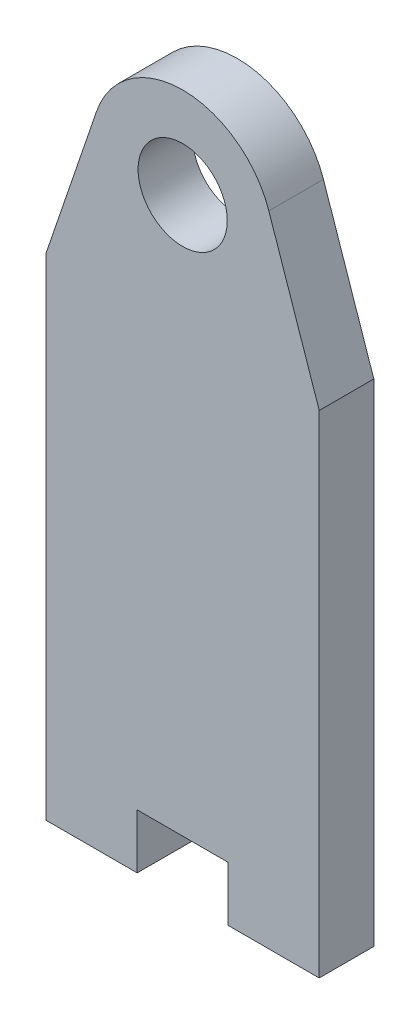
ISO-10303-21;
HEADER;
FILE_DESCRIPTION(('STEP AP214'),'2;1');
FILE_NAME('part.step','',(''),(''),'','','');
FILE_SCHEMA(('AUTOMOTIVE_DESIGN { 1 0 10303 214 1 1 1 1 }'));
ENDSEC;
DATA;
#1=APPLICATION_CONTEXT('core data for automotive mechanical design processes');
#2=APPLICATION_PROTOCOL_DEFINITION('international standard','automotive_design',2000,#1);
#3=PRODUCT_CONTEXT('',#1,'mechanical');
#4=PRODUCT('Part','Part','',(#3));
#5=PRODUCT_RELATED_PRODUCT_CATEGORY('part','',(#4));
#6=PRODUCT_DEFINITION_FORMATION('','',#4);
#7=PRODUCT_DEFINITION_CONTEXT('part definition',#1,'design');
#8=PRODUCT_DEFINITION('design','',#6,#7);
#9=PRODUCT_DEFINITION_SHAPE('','',#8);
#10=(LENGTH_UNIT() NAMED_UNIT(*) SI_UNIT(.MILLI.,.METRE.));
#11=(NAMED_UNIT(*) PLANE_ANGLE_UNIT() SI_UNIT($,.RADIAN.));
#12=(NAMED_UNIT(*) SI_UNIT($,.STERADIAN.) SOLID_ANGLE_UNIT());
#13=UNCERTAINTY_MEASURE_WITH_UNIT(LENGTH_MEASURE(1.E-05),#10,'distance_accuracy_value','');
#14=(GEOMETRIC_REPRESENTATION_CONTEXT(3) GLOBAL_UNCERTAINTY_ASSIGNED_CONTEXT((#13)) GLOBAL_UNIT_ASSIGNED_CONTEXT((#10,
#11,#12)) REPRESENTATION_CONTEXT('',''));
#15=CARTESIAN_POINT('',(0.,0.,0.));
#16=DIRECTION('',(0.,0.,1.));
#17=DIRECTION('',(1.,0.,0.));
#18=AXIS2_PLACEMENT_3D('',#15,#16,#17);
#19=CARTESIAN_POINT('',(28.9055016360546,30.9500000000045,3.));
#20=DIRECTION('',(0.,0.,1.));
#21=DIRECTION('',(1.,0.,0.));
#22=AXIS2_PLACEMENT_3D('',#19,#20,#21);
#23=PLANE('',#22);
#24=CARTESIAN_POINT('',(28.9055016360546,30.9500000000045,3.));
#25=DIRECTION('',(0.,0.,1.));
#26=DIRECTION('',(1.,0.,0.));
#27=AXIS2_PLACEMENT_3D('',#24,#25,#26);
#28=CIRCLE('',#27,5.00000000001172);
#29=CARTESIAN_POINT('',(33.6377803999347,32.5641678044929,3.));
#30=VERTEX_POINT('',#29);
#31=CARTESIAN_POINT('',(24.1732228721651,32.5641678044652,3.));
#32=VERTEX_POINT('',#31);
#33=EDGE_CURVE('E160',#30,#32,#28,.T.);
#34=ORIENTED_EDGE('',*,*,#33,.T.);
#35=DIRECTION('',(-0.322833560893949,-0.94645575277481,0.));
#36=VECTOR('',#35,1.);
#37=CARTESIAN_POINT('',(21.4055016360392,24.4499999999943,3.));
#38=LINE('',#37,#36);
#39=CARTESIAN_POINT('',(21.4055016360392,24.4499999999943,3.));
#40=VERTEX_POINT('',#39);
#41=EDGE_CURVE('E98',#32,#40,#38,.T.);
#42=ORIENTED_EDGE('',*,*,#41,.T.);
#43=DIRECTION('',(0.,-1.,0.));
#44=VECTOR('',#43,1.);
#45=CARTESIAN_POINT('',(21.4055016360392,24.4499999999943,3.));
#46=LINE('',#45,#44);
#47=CARTESIAN_POINT('',(21.4055016360392,-2.55000000000574,3.));
#48=VERTEX_POINT('',#47);
#49=EDGE_CURVE('E181',#40,#48,#46,.T.);
#50=ORIENTED_EDGE('',*,*,#49,.T.);
#51=DIRECTION('',(1.,2.1605980893295E-13,0.));
#52=VECTOR('',#51,1.);
#53=CARTESIAN_POINT('',(26.4055016360383,-2.55000000000466,3.));
#54=LINE('',#53,#52);
#55=CARTESIAN_POINT('',(26.4055016360383,-2.55000000000466,3.));
#56=VERTEX_POINT('',#55);
#57=EDGE_CURVE('E200',#48,#56,#54,.T.);
#58=ORIENTED_EDGE('',*,*,#57,.T.);
#59=DIRECTION('',(0.,1.,0.));
#60=VECTOR('',#59,1.);
#61=CARTESIAN_POINT('',(26.4055016360383,0.449999999995338,3.));
#62=LINE('',#61,#60);
#63=CARTESIAN_POINT('',(26.4055016360383,0.449999999995338,3.));
#64=VERTEX_POINT('',#63);
#65=EDGE_CURVE('E197',#56,#64,#62,.T.);
#66=ORIENTED_EDGE('',*,*,#65,.T.);
#67=DIRECTION('',(1.,0.,0.));
#68=VECTOR('',#67,1.);
#69=CARTESIAN_POINT('',(31.4055016360383,0.449999999995338,3.));
#70=LINE('',#69,#68);
#71=CARTESIAN_POINT('',(31.4055016360383,0.449999999995338,3.));
#72=VERTEX_POINT('',#71);
#73=EDGE_CURVE('E199',#64,#72,#70,.T.);
#74=ORIENTED_EDGE('',*,*,#73,.T.);
#75=DIRECTION('',(0.,-1.,0.));
#76=VECTOR('',#75,1.);
#77=CARTESIAN_POINT('',(31.4055016360383,-2.55000000000466,3.));
#78=LINE('',#77,#76);
#79=CARTESIAN_POINT('',(31.4055016360383,-2.55000000000466,3.));
#80=VERTEX_POINT('',#79);
#81=EDGE_CURVE('E123',#72,#80,#78,.T.);
#82=ORIENTED_EDGE('',*,*,#81,.T.);
#83=DIRECTION('',(1.,4.18588774753204E-13,0.));
#84=VECTOR('',#83,1.);
#85=CARTESIAN_POINT('',(36.4055016360383,-2.55000000000257,3.));
#86=LINE('',#85,#84);
#87=CARTESIAN_POINT('',(36.4055016360383,-2.55000000000257,3.));
#88=VERTEX_POINT('',#87);
#89=EDGE_CURVE('E117',#80,#88,#86,.T.);
#90=ORIENTED_EDGE('',*,*,#89,.T.);
#91=DIRECTION('',(0.,1.,0.));
#92=VECTOR('',#91,1.);
#93=CARTESIAN_POINT('',(36.4055016360383,24.4499999999943,3.));
#94=LINE('',#93,#92);
#95=CARTESIAN_POINT('',(36.4055016360383,24.4499999999943,3.));
#96=VERTEX_POINT('',#95);
#97=EDGE_CURVE('E121',#88,#96,#94,.T.);
#98=ORIENTED_EDGE('',*,*,#97,.T.);
#99=DIRECTION('',(-0.322833560890626,0.946455752775944,0.));
#100=VECTOR('',#99,1.);
#101=CARTESIAN_POINT('',(33.6377803999347,32.5641678044929,3.));
#102=LINE('',#101,#100);
#103=EDGE_CURVE('E49',#96,#30,#102,.T.);
#104=ORIENTED_EDGE('',*,*,#103,.T.);
#105=EDGE_LOOP('',(#34,#42,#50,#58,#66,#74,#82,#90,#98,#104));
#106=FACE_BOUND('',#105,.T.);
#107=CARTESIAN_POINT('',(28.9040840134805,30.9499999999941,3.));
#108=DIRECTION('',(0.,0.,1.));
#109=DIRECTION('',(1.,0.,0.));
#110=AXIS2_PLACEMENT_3D('',#107,#108,#109);
#111=CIRCLE('',#110,2.45);
#112=CARTESIAN_POINT('',(31.3540840134804,30.9499999999941,3.));
#113=VERTEX_POINT('',#112);
#114=EDGE_CURVE('E145',#113,#113,#111,.T.);
#115=ORIENTED_EDGE('',*,*,#114,.F.);
#116=EDGE_LOOP('',(#115));
#117=FACE_BOUND('',#116,.T.);
#118=ADVANCED_FACE('F32',(#106,#117),#23,.T.);
#119=CARTESIAN_POINT('',(28.9055016360546,30.9500000000045,0.));
#120=DIRECTION('',(0.,0.,1.));
#121=DIRECTION('',(1.,0.,0.));
#122=AXIS2_PLACEMENT_3D('',#119,#120,#121);
#123=PLANE('',#122);
#124=CARTESIAN_POINT('',(28.9055016360546,30.9500000000045,0.));
#125=DIRECTION('',(0.,0.,1.));
#126=DIRECTION('',(1.,0.,0.));
#127=AXIS2_PLACEMENT_3D('',#124,#125,#126);
#128=CIRCLE('',#127,5.00000000001172);
#129=CARTESIAN_POINT('',(33.6377803999347,32.5641678044929,0.));
#130=VERTEX_POINT('',#129);
#131=CARTESIAN_POINT('',(24.1732228721651,32.5641678044652,0.));
#132=VERTEX_POINT('',#131);
#133=EDGE_CURVE('E141',#130,#132,#128,.T.);
#134=ORIENTED_EDGE('',*,*,#133,.F.);
#135=DIRECTION('',(-0.322833560890626,0.946455752775944,0.));
#136=VECTOR('',#135,1.);
#137=CARTESIAN_POINT('',(33.6377803999347,32.5641678044929,0.));
#138=LINE('',#137,#136);
#139=CARTESIAN_POINT('',(36.4055016360383,24.4499999999943,0.));
#140=VERTEX_POINT('',#139);
#141=EDGE_CURVE('E90',#140,#130,#138,.T.);
#142=ORIENTED_EDGE('',*,*,#141,.F.);
#143=DIRECTION('',(0.,1.,0.));
#144=VECTOR('',#143,1.);
#145=CARTESIAN_POINT('',(36.4055016360383,24.4499999999943,0.));
#146=LINE('',#145,#144);
#147=CARTESIAN_POINT('',(36.4055016360383,-2.55000000000257,0.));
#148=VERTEX_POINT('',#147);
#149=EDGE_CURVE('E84',#148,#140,#146,.T.);
#150=ORIENTED_EDGE('',*,*,#149,.F.);
#151=DIRECTION('',(1.,4.18588774753204E-13,0.));
#152=VECTOR('',#151,1.);
#153=CARTESIAN_POINT('',(36.4055016360383,-2.55000000000257,0.));
#154=LINE('',#153,#152);
#155=CARTESIAN_POINT('',(31.4055016360383,-2.55000000000466,0.));
#156=VERTEX_POINT('',#155);
#157=EDGE_CURVE('E131',#156,#148,#154,.T.);
#158=ORIENTED_EDGE('',*,*,#157,.F.);
#159=DIRECTION('',(0.,-1.,0.));
#160=VECTOR('',#159,1.);
#161=CARTESIAN_POINT('',(31.4055016360383,-2.55000000000466,0.));
#162=LINE('',#161,#160);
#163=CARTESIAN_POINT('',(31.4055016360383,0.449999999995338,0.));
#164=VERTEX_POINT('',#163);
#165=EDGE_CURVE('E155',#164,#156,#162,.T.);
#166=ORIENTED_EDGE('',*,*,#165,.F.);
#167=DIRECTION('',(1.,0.,0.));
#168=VECTOR('',#167,1.);
#169=CARTESIAN_POINT('',(31.4055016360383,0.449999999995338,0.));
#170=LINE('',#169,#168);
#171=CARTESIAN_POINT('',(26.4055016360383,0.449999999995338,0.));
#172=VERTEX_POINT('',#171);
#173=EDGE_CURVE('E153',#172,#164,#170,.T.);
#174=ORIENTED_EDGE('',*,*,#173,.F.);
#175=DIRECTION('',(0.,1.,0.));
#176=VECTOR('',#175,1.);
#177=CARTESIAN_POINT('',(26.4055016360383,0.449999999995338,0.));
#178=LINE('',#177,#176);
#179=CARTESIAN_POINT('',(26.4055016360383,-2.55000000000466,0.));
#180=VERTEX_POINT('',#179);
#181=EDGE_CURVE('E151',#180,#172,#178,.T.);
#182=ORIENTED_EDGE('',*,*,#181,.F.);
#183=DIRECTION('',(1.,2.1605980893295E-13,0.));
#184=VECTOR('',#183,1.);
#185=CARTESIAN_POINT('',(26.4055016360383,-2.55000000000466,0.));
#186=LINE('',#185,#184);
#187=CARTESIAN_POINT('',(21.4055016360392,-2.55000000000574,0.));
#188=VERTEX_POINT('',#187);
#189=EDGE_CURVE('E149',#188,#180,#186,.T.);
#190=ORIENTED_EDGE('',*,*,#189,.F.);
#191=DIRECTION('',(0.,-1.,0.));
#192=VECTOR('',#191,1.);
#193=CARTESIAN_POINT('',(21.4055016360392,24.4499999999943,0.));
#194=LINE('',#193,#192);
#195=CARTESIAN_POINT('',(21.4055016360392,24.4499999999943,0.));
#196=VERTEX_POINT('',#195);
#197=EDGE_CURVE('E147',#196,#188,#194,.T.);
#198=ORIENTED_EDGE('',*,*,#197,.F.);
#199=DIRECTION('',(-0.322833560893949,-0.94645575277481,0.));
#200=VECTOR('',#199,1.);
#201=CARTESIAN_POINT('',(21.4055016360392,24.4499999999943,0.));
#202=LINE('',#201,#200);
#203=EDGE_CURVE('E144',#132,#196,#202,.T.);
#204=ORIENTED_EDGE('',*,*,#203,.F.);
#205=EDGE_LOOP('',(#134,#142,#150,#158,#166,#174,#182,#190,#198,#204));
#206=FACE_BOUND('',#205,.T.);
#207=CARTESIAN_POINT('',(28.9040840134805,30.9499999999941,0.));
#208=DIRECTION('',(0.,0.,1.));
#209=DIRECTION('',(1.,0.,0.));
#210=AXIS2_PLACEMENT_3D('',#207,#208,#209);
#211=CIRCLE('',#210,2.45);
#212=CARTESIAN_POINT('',(31.3540840134804,30.9499999999941,0.));
#213=VERTEX_POINT('',#212);
#214=EDGE_CURVE('E208',#213,#213,#211,.T.);
#215=ORIENTED_EDGE('',*,*,#214,.T.);
#216=EDGE_LOOP('',(#215));
#217=FACE_BOUND('',#216,.T.);
#218=ADVANCED_FACE('F185',(#206,#217),#123,.F.);
#219=CARTESIAN_POINT('',(28.9055016360546,30.9500000000045,3.));
#220=DIRECTION('',(0.,0.,-1.));
#221=DIRECTION('',(-1.,0.,0.));
#222=AXIS2_PLACEMENT_3D('',#219,#220,#221);
#223=CYLINDRICAL_SURFACE('',#222,5.00000000001172);
#224=ORIENTED_EDGE('',*,*,#133,.T.);
#225=DIRECTION('',(0.,0.,-1.));
#226=VECTOR('',#225,1.);
#227=CARTESIAN_POINT('',(24.1732228721651,32.5641678044652,3.));
#228=LINE('',#227,#226);
#229=EDGE_CURVE('E11',#32,#132,#228,.T.);
#230=ORIENTED_EDGE('',*,*,#229,.F.);
#231=ORIENTED_EDGE('',*,*,#33,.F.);
#232=DIRECTION('',(0.,0.,-1.));
#233=VECTOR('',#232,1.);
#234=CARTESIAN_POINT('',(33.6377803999347,32.5641678044929,3.));
#235=LINE('',#234,#233);
#236=EDGE_CURVE('E137',#30,#130,#235,.T.);
#237=ORIENTED_EDGE('',*,*,#236,.T.);
#238=EDGE_LOOP('',(#224,#230,#231,#237));
#239=FACE_BOUND('',#238,.T.);
#240=ADVANCED_FACE('F34',(#239),#223,.T.);
#241=CARTESIAN_POINT('',(21.4055016360392,24.4499999999943,3.));
#242=DIRECTION('',(0.94645575277481,-0.322833560893949,0.));
#243=DIRECTION('',(0.322833560893949,0.946455752774811,0.));
#244=AXIS2_PLACEMENT_3D('',#241,#242,#243);
#245=PLANE('',#244);
#246=ORIENTED_EDGE('',*,*,#203,.T.);
#247=DIRECTION('',(0.,0.,-1.));
#248=VECTOR('',#247,1.);
#249=CARTESIAN_POINT('',(21.4055016360392,24.4499999999943,3.));
#250=LINE('',#249,#248);
#251=EDGE_CURVE('E41',#40,#196,#250,.T.);
#252=ORIENTED_EDGE('',*,*,#251,.F.);
#253=ORIENTED_EDGE('',*,*,#41,.F.);
#254=ORIENTED_EDGE('',*,*,#229,.T.);
#255=EDGE_LOOP('',(#246,#252,#253,#254));
#256=FACE_BOUND('',#255,.T.);
#257=ADVANCED_FACE('F244',(#256),#245,.F.);
#258=CARTESIAN_POINT('',(21.4055016360392,24.4499999999943,3.));
#259=DIRECTION('',(1.,0.,0.));
#260=DIRECTION('',(0.,0.,-1.));
#261=AXIS2_PLACEMENT_3D('',#258,#259,#260);
#262=PLANE('',#261);
#263=ORIENTED_EDGE('',*,*,#197,.T.);
#264=DIRECTION('',(0.,0.,-1.));
#265=VECTOR('',#264,1.);
#266=CARTESIAN_POINT('',(21.4055016360392,-2.55000000000574,3.));
#267=LINE('',#266,#265);
#268=EDGE_CURVE('E173',#48,#188,#267,.T.);
#269=ORIENTED_EDGE('',*,*,#268,.F.);
#270=ORIENTED_EDGE('',*,*,#49,.F.);
#271=ORIENTED_EDGE('',*,*,#251,.T.);
#272=EDGE_LOOP('',(#263,#269,#270,#271));
#273=FACE_BOUND('',#272,.T.);
#274=ADVANCED_FACE('F179',(#273),#262,.F.);
#275=CARTESIAN_POINT('',(26.4055016360383,-2.55000000000466,3.));
#276=DIRECTION('',(-2.1605980893295E-13,1.,0.));
#277=DIRECTION('',(-1.,-2.1605980893295E-13,0.));
#278=AXIS2_PLACEMENT_3D('',#275,#276,#277);
#279=PLANE('',#278);
#280=ORIENTED_EDGE('',*,*,#189,.T.);
#281=DIRECTION('',(0.,0.,-1.));
#282=VECTOR('',#281,1.);
#283=CARTESIAN_POINT('',(26.4055016360383,-2.55000000000466,3.));
#284=LINE('',#283,#282);
#285=EDGE_CURVE('E170',#56,#180,#284,.T.);
#286=ORIENTED_EDGE('',*,*,#285,.F.);
#287=ORIENTED_EDGE('',*,*,#57,.F.);
#288=ORIENTED_EDGE('',*,*,#268,.T.);
#289=EDGE_LOOP('',(#280,#286,#287,#288));
#290=FACE_BOUND('',#289,.T.);
#291=ADVANCED_FACE('F191',(#290),#279,.F.);
#292=CARTESIAN_POINT('',(26.4055016360383,0.449999999995338,3.));
#293=DIRECTION('',(-1.,0.,0.));
#294=DIRECTION('',(0.,0.,1.));
#295=AXIS2_PLACEMENT_3D('',#292,#293,#294);
#296=PLANE('',#295);
#297=ORIENTED_EDGE('',*,*,#181,.T.);
#298=DIRECTION('',(0.,0.,-1.));
#299=VECTOR('',#298,1.);
#300=CARTESIAN_POINT('',(26.4055016360383,0.449999999995338,3.));
#301=LINE('',#300,#299);
#302=EDGE_CURVE('E167',#64,#172,#301,.T.);
#303=ORIENTED_EDGE('',*,*,#302,.F.);
#304=ORIENTED_EDGE('',*,*,#65,.F.);
#305=ORIENTED_EDGE('',*,*,#285,.T.);
#306=EDGE_LOOP('',(#297,#303,#304,#305));
#307=FACE_BOUND('',#306,.T.);
#308=ADVANCED_FACE('F195',(#307),#296,.F.);
#309=CARTESIAN_POINT('',(31.4055016360383,0.449999999995338,3.));
#310=DIRECTION('',(0.,1.,0.));
#311=DIRECTION('',(0.,0.,1.));
#312=AXIS2_PLACEMENT_3D('',#309,#310,#311);
#313=PLANE('',#312);
#314=ORIENTED_EDGE('',*,*,#173,.T.);
#315=DIRECTION('',(0.,0.,-1.));
#316=VECTOR('',#315,1.);
#317=CARTESIAN_POINT('',(31.4055016360383,0.449999999995338,3.));
#318=LINE('',#317,#316);
#319=EDGE_CURVE('E164',#72,#164,#318,.T.);
#320=ORIENTED_EDGE('',*,*,#319,.F.);
#321=ORIENTED_EDGE('',*,*,#73,.F.);
#322=ORIENTED_EDGE('',*,*,#302,.T.);
#323=EDGE_LOOP('',(#314,#320,#321,#322));
#324=FACE_BOUND('',#323,.T.);
#325=ADVANCED_FACE('F234',(#324),#313,.F.);
#326=CARTESIAN_POINT('',(31.4055016360383,-2.55000000000466,3.));
#327=DIRECTION('',(1.,0.,0.));
#328=DIRECTION('',(0.,0.,-1.));
#329=AXIS2_PLACEMENT_3D('',#326,#327,#328);
#330=PLANE('',#329);
#331=ORIENTED_EDGE('',*,*,#165,.T.);
#332=DIRECTION('',(0.,0.,-1.));
#333=VECTOR('',#332,1.);
#334=CARTESIAN_POINT('',(31.4055016360383,-2.55000000000466,3.));
#335=LINE('',#334,#333);
#336=EDGE_CURVE('E132',#80,#156,#335,.T.);
#337=ORIENTED_EDGE('',*,*,#336,.F.);
#338=ORIENTED_EDGE('',*,*,#81,.F.);
#339=ORIENTED_EDGE('',*,*,#319,.T.);
#340=EDGE_LOOP('',(#331,#337,#338,#339));
#341=FACE_BOUND('',#340,.T.);
#342=ADVANCED_FACE('F231',(#341),#330,.F.);
#343=CARTESIAN_POINT('',(36.4055016360383,-2.55000000000257,3.));
#344=DIRECTION('',(-4.18588774753204E-13,1.,0.));
#345=DIRECTION('',(-1.,-4.18588774753204E-13,0.));
#346=AXIS2_PLACEMENT_3D('',#343,#344,#345);
#347=PLANE('',#346);
#348=ORIENTED_EDGE('',*,*,#157,.T.);
#349=DIRECTION('',(0.,0.,-1.));
#350=VECTOR('',#349,1.);
#351=CARTESIAN_POINT('',(36.4055016360383,-2.55000000000257,3.));
#352=LINE('',#351,#350);
#353=EDGE_CURVE('E128',#88,#148,#352,.T.);
#354=ORIENTED_EDGE('',*,*,#353,.F.);
#355=ORIENTED_EDGE('',*,*,#89,.F.);
#356=ORIENTED_EDGE('',*,*,#336,.T.);
#357=EDGE_LOOP('',(#348,#354,#355,#356));
#358=FACE_BOUND('',#357,.T.);
#359=ADVANCED_FACE('F129',(#358),#347,.F.);
#360=CARTESIAN_POINT('',(36.4055016360383,24.4499999999943,3.));
#361=DIRECTION('',(-1.,0.,0.));
#362=DIRECTION('',(0.,0.,1.));
#363=AXIS2_PLACEMENT_3D('',#360,#361,#362);
#364=PLANE('',#363);
#365=ORIENTED_EDGE('',*,*,#149,.T.);
#366=DIRECTION('',(0.,0.,-1.));
#367=VECTOR('',#366,1.);
#368=CARTESIAN_POINT('',(36.4055016360383,24.4499999999943,3.));
#369=LINE('',#368,#367);
#370=EDGE_CURVE('E133',#96,#140,#369,.T.);
#371=ORIENTED_EDGE('',*,*,#370,.F.);
#372=ORIENTED_EDGE('',*,*,#97,.F.);
#373=ORIENTED_EDGE('',*,*,#353,.T.);
#374=EDGE_LOOP('',(#365,#371,#372,#373));
#375=FACE_BOUND('',#374,.T.);
#376=ADVANCED_FACE('F135',(#375),#364,.F.);
#377=CARTESIAN_POINT('',(33.6377803999347,32.5641678044929,3.));
#378=DIRECTION('',(-0.946455752775944,-0.322833560890626,0.));
#379=DIRECTION('',(0.322833560890626,-0.946455752775944,0.));
#380=AXIS2_PLACEMENT_3D('',#377,#378,#379);
#381=PLANE('',#380);
#382=ORIENTED_EDGE('',*,*,#141,.T.);
#383=ORIENTED_EDGE('',*,*,#236,.F.);
#384=ORIENTED_EDGE('',*,*,#103,.F.);
#385=ORIENTED_EDGE('',*,*,#370,.T.);
#386=EDGE_LOOP('',(#382,#383,#384,#385));
#387=FACE_BOUND('',#386,.T.);
#388=ADVANCED_FACE('F224',(#387),#381,.F.);
#389=CARTESIAN_POINT('',(28.9040840134805,30.9499999999941,3.));
#390=DIRECTION('',(0.,0.,-1.));
#391=DIRECTION('',(-1.,0.,0.));
#392=AXIS2_PLACEMENT_3D('',#389,#390,#391);
#393=CYLINDRICAL_SURFACE('',#392,2.45);
#394=ORIENTED_EDGE('',*,*,#114,.T.);
#395=EDGE_LOOP('',(#394));
#396=FACE_BOUND('',#395,.T.);
#397=ORIENTED_EDGE('',*,*,#214,.F.);
#398=EDGE_LOOP('',(#397));
#399=FACE_BOUND('',#398,.T.);
#400=ADVANCED_FACE('F214',(#396,#399),#393,.F.);
#401=CLOSED_SHELL('',(#118,#218,#240,#257,#274,#291,#308,#325,#342,#359,#376,#388,#400));
#402=MANIFOLD_SOLID_BREP('B2',#401);
#403=ADVANCED_BREP_SHAPE_REPRESENTATION('',(#18,#402),#14);
#404=SHAPE_DEFINITION_REPRESENTATION(#9,#403);
ENDSEC;
END-ISO-10303-21;
